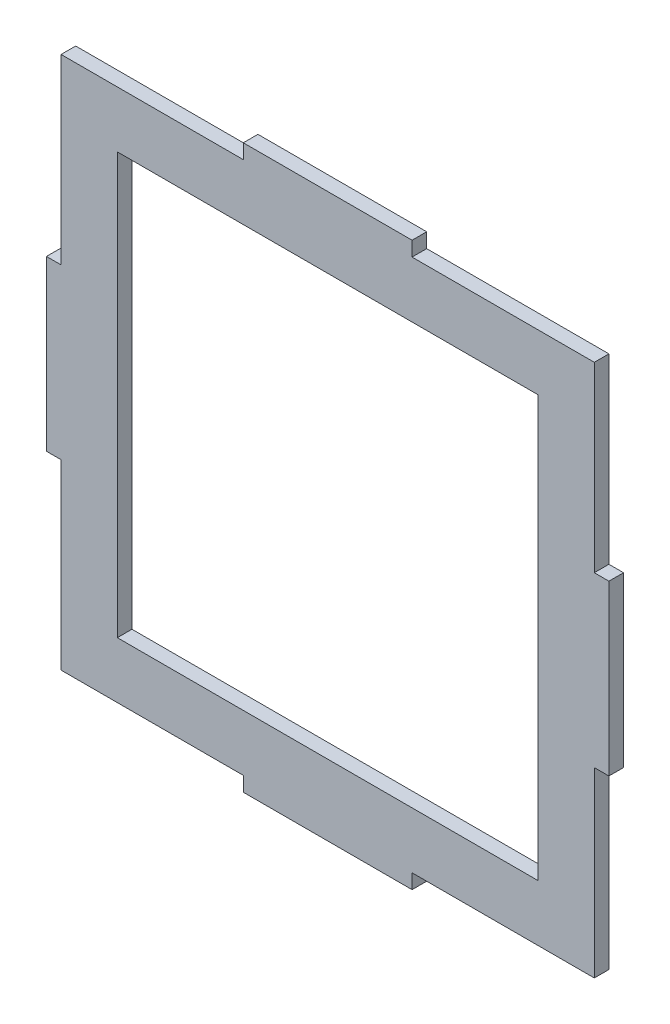
ISO-10303-21;
HEADER;
FILE_DESCRIPTION(('STEP AP214'),'2;1');
FILE_NAME('part.step','',(''),(''),'','','');
FILE_SCHEMA(('AUTOMOTIVE_DESIGN { 1 0 10303 214 1 1 1 1 }'));
ENDSEC;
DATA;
#1=APPLICATION_CONTEXT('core data for automotive mechanical design processes');
#2=APPLICATION_PROTOCOL_DEFINITION('international standard','automotive_design',2000,#1);
#3=PRODUCT_CONTEXT('',#1,'mechanical');
#4=PRODUCT('Part','Part','',(#3));
#5=PRODUCT_RELATED_PRODUCT_CATEGORY('part','',(#4));
#6=PRODUCT_DEFINITION_FORMATION('','',#4);
#7=PRODUCT_DEFINITION_CONTEXT('part definition',#1,'design');
#8=PRODUCT_DEFINITION('design','',#6,#7);
#9=PRODUCT_DEFINITION_SHAPE('','',#8);
#10=(LENGTH_UNIT() NAMED_UNIT(*) SI_UNIT(.MILLI.,.METRE.));
#11=(NAMED_UNIT(*) PLANE_ANGLE_UNIT() SI_UNIT($,.RADIAN.));
#12=(NAMED_UNIT(*) SI_UNIT($,.STERADIAN.) SOLID_ANGLE_UNIT());
#13=UNCERTAINTY_MEASURE_WITH_UNIT(LENGTH_MEASURE(1.E-05),#10,'distance_accuracy_value','');
#14=(GEOMETRIC_REPRESENTATION_CONTEXT(3) GLOBAL_UNCERTAINTY_ASSIGNED_CONTEXT((#13)) GLOBAL_UNIT_ASSIGNED_CONTEXT((#10,
#11,#12)) REPRESENTATION_CONTEXT('',''));
#15=CARTESIAN_POINT('',(0.,0.,0.));
#16=DIRECTION('',(0.,0.,1.));
#17=DIRECTION('',(1.,0.,0.));
#18=AXIS2_PLACEMENT_3D('',#15,#16,#17);
#19=CARTESIAN_POINT('',(0.,0.,2.6));
#20=DIRECTION('',(1.,0.,0.));
#21=DIRECTION('',(0.,1.,0.));
#22=AXIS2_PLACEMENT_3D('',#19,#20,#21);
#23=PLANE('',#22);
#24=DIRECTION('',(0.,-1.,0.));
#25=VECTOR('',#24,1.);
#26=CARTESIAN_POINT('',(0.,0.,0.));
#27=LINE('',#26,#25);
#28=CARTESIAN_POINT('',(0.,32.4,0.));
#29=VERTEX_POINT('',#28);
#30=CARTESIAN_POINT('',(0.,0.,0.));
#31=VERTEX_POINT('',#30);
#32=EDGE_CURVE('E223',#29,#31,#27,.T.);
#33=ORIENTED_EDGE('',*,*,#32,.T.);
#34=DIRECTION('',(0.,0.,-1.));
#35=VECTOR('',#34,1.);
#36=CARTESIAN_POINT('',(0.,0.,2.6));
#37=LINE('',#36,#35);
#38=CARTESIAN_POINT('',(0.,0.,2.6));
#39=VERTEX_POINT('',#38);
#40=EDGE_CURVE('E11',#39,#31,#37,.T.);
#41=ORIENTED_EDGE('',*,*,#40,.F.);
#42=DIRECTION('',(0.,-1.,0.));
#43=VECTOR('',#42,1.);
#44=CARTESIAN_POINT('',(0.,0.,2.6));
#45=LINE('',#44,#43);
#46=CARTESIAN_POINT('',(0.,32.4,2.6));
#47=VERTEX_POINT('',#46);
#48=EDGE_CURVE('E227',#47,#39,#45,.T.);
#49=ORIENTED_EDGE('',*,*,#48,.F.);
#50=DIRECTION('',(0.,0.,-1.));
#51=VECTOR('',#50,1.);
#52=CARTESIAN_POINT('',(0.,32.4,2.6));
#53=LINE('',#52,#51);
#54=EDGE_CURVE('E269',#47,#29,#53,.T.);
#55=ORIENTED_EDGE('',*,*,#54,.T.);
#56=EDGE_LOOP('',(#33,#41,#49,#55));
#57=FACE_BOUND('',#56,.T.);
#58=ADVANCED_FACE('F30',(#57),#23,.F.);
#59=CARTESIAN_POINT('',(0.,0.,2.6));
#60=DIRECTION('',(0.,1.,0.));
#61=DIRECTION('',(0.,0.,1.));
#62=AXIS2_PLACEMENT_3D('',#59,#60,#61);
#63=PLANE('',#62);
#64=DIRECTION('',(1.,0.,0.));
#65=VECTOR('',#64,1.);
#66=CARTESIAN_POINT('',(0.,0.,0.));
#67=LINE('',#66,#65);
#68=CARTESIAN_POINT('',(32.4,0.,0.));
#69=VERTEX_POINT('',#68);
#70=EDGE_CURVE('E272',#31,#69,#67,.T.);
#71=ORIENTED_EDGE('',*,*,#70,.T.);
#72=DIRECTION('',(0.,0.,-1.));
#73=VECTOR('',#72,1.);
#74=CARTESIAN_POINT('',(32.4,0.,2.6));
#75=LINE('',#74,#73);
#76=CARTESIAN_POINT('',(32.4,0.,2.6));
#77=VERTEX_POINT('',#76);
#78=EDGE_CURVE('E37',#77,#69,#75,.T.);
#79=ORIENTED_EDGE('',*,*,#78,.F.);
#80=DIRECTION('',(1.,0.,0.));
#81=VECTOR('',#80,1.);
#82=CARTESIAN_POINT('',(0.,0.,2.6));
#83=LINE('',#82,#81);
#84=EDGE_CURVE('E230',#39,#77,#83,.T.);
#85=ORIENTED_EDGE('',*,*,#84,.F.);
#86=ORIENTED_EDGE('',*,*,#40,.T.);
#87=EDGE_LOOP('',(#71,#79,#85,#86));
#88=FACE_BOUND('',#87,.T.);
#89=ADVANCED_FACE('F387',(#88),#63,.F.);
#90=CARTESIAN_POINT('',(32.4,0.,2.6));
#91=DIRECTION('',(1.,0.,0.));
#92=DIRECTION('',(0.,0.,-1.));
#93=AXIS2_PLACEMENT_3D('',#90,#91,#92);
#94=PLANE('',#93);
#95=DIRECTION('',(0.,-1.,0.));
#96=VECTOR('',#95,1.);
#97=CARTESIAN_POINT('',(32.4,0.,0.));
#98=LINE('',#97,#96);
#99=CARTESIAN_POINT('',(32.4,-2.60000000000001,0.));
#100=VERTEX_POINT('',#99);
#101=EDGE_CURVE('E274',#69,#100,#98,.T.);
#102=ORIENTED_EDGE('',*,*,#101,.T.);
#103=DIRECTION('',(0.,0.,-1.));
#104=VECTOR('',#103,1.);
#105=CARTESIAN_POINT('',(32.4,-2.60000000000001,2.6));
#106=LINE('',#105,#104);
#107=CARTESIAN_POINT('',(32.4,-2.60000000000001,2.6));
#108=VERTEX_POINT('',#107);
#109=EDGE_CURVE('E359',#108,#100,#106,.T.);
#110=ORIENTED_EDGE('',*,*,#109,.F.);
#111=DIRECTION('',(0.,-1.,0.));
#112=VECTOR('',#111,1.);
#113=CARTESIAN_POINT('',(32.4,0.,2.6));
#114=LINE('',#113,#112);
#115=EDGE_CURVE('E233',#77,#108,#114,.T.);
#116=ORIENTED_EDGE('',*,*,#115,.F.);
#117=ORIENTED_EDGE('',*,*,#78,.T.);
#118=EDGE_LOOP('',(#102,#110,#116,#117));
#119=FACE_BOUND('',#118,.T.);
#120=ADVANCED_FACE('F366',(#119),#94,.F.);
#121=CARTESIAN_POINT('',(62.4,-2.6,2.6));
#122=DIRECTION('',(0.,1.,0.));
#123=DIRECTION('',(-1.,0.,0.));
#124=AXIS2_PLACEMENT_3D('',#121,#122,#123);
#125=PLANE('',#124);
#126=DIRECTION('',(1.,0.,0.));
#127=VECTOR('',#126,1.);
#128=CARTESIAN_POINT('',(62.4,-2.6,0.));
#129=LINE('',#128,#127);
#130=CARTESIAN_POINT('',(62.4,-2.6,0.));
#131=VERTEX_POINT('',#130);
#132=EDGE_CURVE('E276',#100,#131,#129,.T.);
#133=ORIENTED_EDGE('',*,*,#132,.T.);
#134=DIRECTION('',(0.,0.,-1.));
#135=VECTOR('',#134,1.);
#136=CARTESIAN_POINT('',(62.4,-2.6,2.6));
#137=LINE('',#136,#135);
#138=CARTESIAN_POINT('',(62.4,-2.6,2.6));
#139=VERTEX_POINT('',#138);
#140=EDGE_CURVE('E356',#139,#131,#137,.T.);
#141=ORIENTED_EDGE('',*,*,#140,.F.);
#142=DIRECTION('',(1.,0.,0.));
#143=VECTOR('',#142,1.);
#144=CARTESIAN_POINT('',(62.4,-2.6,2.6));
#145=LINE('',#144,#143);
#146=EDGE_CURVE('E235',#108,#139,#145,.T.);
#147=ORIENTED_EDGE('',*,*,#146,.F.);
#148=ORIENTED_EDGE('',*,*,#109,.T.);
#149=EDGE_LOOP('',(#133,#141,#147,#148));
#150=FACE_BOUND('',#149,.T.);
#151=ADVANCED_FACE('F375',(#150),#125,.F.);
#152=CARTESIAN_POINT('',(62.4,0.,2.6));
#153=DIRECTION('',(-1.,0.,0.));
#154=DIRECTION('',(0.,-1.,0.));
#155=AXIS2_PLACEMENT_3D('',#152,#153,#154);
#156=PLANE('',#155);
#157=DIRECTION('',(0.,1.,0.));
#158=VECTOR('',#157,1.);
#159=CARTESIAN_POINT('',(62.4,0.,0.));
#160=LINE('',#159,#158);
#161=CARTESIAN_POINT('',(62.4,0.,0.));
#162=VERTEX_POINT('',#161);
#163=EDGE_CURVE('E278',#131,#162,#160,.T.);
#164=ORIENTED_EDGE('',*,*,#163,.T.);
#165=DIRECTION('',(0.,0.,-1.));
#166=VECTOR('',#165,1.);
#167=CARTESIAN_POINT('',(62.4,0.,2.6));
#168=LINE('',#167,#166);
#169=CARTESIAN_POINT('',(62.4,0.,2.6));
#170=VERTEX_POINT('',#169);
#171=EDGE_CURVE('E353',#170,#162,#168,.T.);
#172=ORIENTED_EDGE('',*,*,#171,.F.);
#173=DIRECTION('',(0.,1.,0.));
#174=VECTOR('',#173,1.);
#175=CARTESIAN_POINT('',(62.4,0.,2.6));
#176=LINE('',#175,#174);
#177=EDGE_CURVE('E237',#139,#170,#176,.T.);
#178=ORIENTED_EDGE('',*,*,#177,.F.);
#179=ORIENTED_EDGE('',*,*,#140,.T.);
#180=EDGE_LOOP('',(#164,#172,#178,#179));
#181=FACE_BOUND('',#180,.T.);
#182=ADVANCED_FACE('F379',(#181),#156,.F.);
#183=CARTESIAN_POINT('',(62.4,0.,2.6));
#184=DIRECTION('',(0.,1.,0.));
#185=DIRECTION('',(0.,0.,1.));
#186=AXIS2_PLACEMENT_3D('',#183,#184,#185);
#187=PLANE('',#186);
#188=DIRECTION('',(1.,0.,0.));
#189=VECTOR('',#188,1.);
#190=CARTESIAN_POINT('',(62.4,0.,0.));
#191=LINE('',#190,#189);
#192=CARTESIAN_POINT('',(94.8,0.,0.));
#193=VERTEX_POINT('',#192);
#194=EDGE_CURVE('E280',#162,#193,#191,.T.);
#195=ORIENTED_EDGE('',*,*,#194,.T.);
#196=DIRECTION('',(0.,0.,-1.));
#197=VECTOR('',#196,1.);
#198=CARTESIAN_POINT('',(94.8,0.,2.6));
#199=LINE('',#198,#197);
#200=CARTESIAN_POINT('',(94.8,0.,2.6));
#201=VERTEX_POINT('',#200);
#202=EDGE_CURVE('E350',#201,#193,#199,.T.);
#203=ORIENTED_EDGE('',*,*,#202,.F.);
#204=DIRECTION('',(1.,0.,0.));
#205=VECTOR('',#204,1.);
#206=CARTESIAN_POINT('',(62.4,0.,2.6));
#207=LINE('',#206,#205);
#208=EDGE_CURVE('E239',#170,#201,#207,.T.);
#209=ORIENTED_EDGE('',*,*,#208,.F.);
#210=ORIENTED_EDGE('',*,*,#171,.T.);
#211=EDGE_LOOP('',(#195,#203,#209,#210));
#212=FACE_BOUND('',#211,.T.);
#213=ADVANCED_FACE('F460',(#212),#187,.F.);
#214=CARTESIAN_POINT('',(94.8,0.,2.6));
#215=DIRECTION('',(-1.,0.,0.));
#216=DIRECTION('',(0.,0.,1.));
#217=AXIS2_PLACEMENT_3D('',#214,#215,#216);
#218=PLANE('',#217);
#219=DIRECTION('',(0.,1.,0.));
#220=VECTOR('',#219,1.);
#221=CARTESIAN_POINT('',(94.8,0.,0.));
#222=LINE('',#221,#220);
#223=CARTESIAN_POINT('',(94.8,32.4,0.));
#224=VERTEX_POINT('',#223);
#225=EDGE_CURVE('E282',#193,#224,#222,.T.);
#226=ORIENTED_EDGE('',*,*,#225,.T.);
#227=DIRECTION('',(0.,0.,-1.));
#228=VECTOR('',#227,1.);
#229=CARTESIAN_POINT('',(94.8,32.4,2.6));
#230=LINE('',#229,#228);
#231=CARTESIAN_POINT('',(94.8,32.4,2.6));
#232=VERTEX_POINT('',#231);
#233=EDGE_CURVE('E347',#232,#224,#230,.T.);
#234=ORIENTED_EDGE('',*,*,#233,.F.);
#235=DIRECTION('',(0.,1.,0.));
#236=VECTOR('',#235,1.);
#237=CARTESIAN_POINT('',(94.8,0.,2.6));
#238=LINE('',#237,#236);
#239=EDGE_CURVE('E241',#201,#232,#238,.T.);
#240=ORIENTED_EDGE('',*,*,#239,.F.);
#241=ORIENTED_EDGE('',*,*,#202,.T.);
#242=EDGE_LOOP('',(#226,#234,#240,#241));
#243=FACE_BOUND('',#242,.T.);
#244=ADVANCED_FACE('F458',(#243),#218,.F.);
#245=CARTESIAN_POINT('',(94.8,32.4,2.6));
#246=DIRECTION('',(0.,1.,0.));
#247=DIRECTION('',(-1.,0.,0.));
#248=AXIS2_PLACEMENT_3D('',#245,#246,#247);
#249=PLANE('',#248);
#250=DIRECTION('',(1.,0.,0.));
#251=VECTOR('',#250,1.);
#252=CARTESIAN_POINT('',(94.8,32.4,0.));
#253=LINE('',#252,#251);
#254=CARTESIAN_POINT('',(97.4,32.4,0.));
#255=VERTEX_POINT('',#254);
#256=EDGE_CURVE('E284',#224,#255,#253,.T.);
#257=ORIENTED_EDGE('',*,*,#256,.T.);
#258=DIRECTION('',(0.,0.,-1.));
#259=VECTOR('',#258,1.);
#260=CARTESIAN_POINT('',(97.4,32.4,2.6));
#261=LINE('',#260,#259);
#262=CARTESIAN_POINT('',(97.4,32.4,2.6));
#263=VERTEX_POINT('',#262);
#264=EDGE_CURVE('E344',#263,#255,#261,.T.);
#265=ORIENTED_EDGE('',*,*,#264,.F.);
#266=DIRECTION('',(1.,0.,0.));
#267=VECTOR('',#266,1.);
#268=CARTESIAN_POINT('',(94.8,32.4,2.6));
#269=LINE('',#268,#267);
#270=EDGE_CURVE('E243',#232,#263,#269,.T.);
#271=ORIENTED_EDGE('',*,*,#270,.F.);
#272=ORIENTED_EDGE('',*,*,#233,.T.);
#273=EDGE_LOOP('',(#257,#265,#271,#272));
#274=FACE_BOUND('',#273,.T.);
#275=ADVANCED_FACE('F453',(#274),#249,.F.);
#276=CARTESIAN_POINT('',(97.4,62.4,2.6));
#277=DIRECTION('',(-1.,0.,0.));
#278=DIRECTION('',(0.,0.,1.));
#279=AXIS2_PLACEMENT_3D('',#276,#277,#278);
#280=PLANE('',#279);
#281=DIRECTION('',(0.,1.,0.));
#282=VECTOR('',#281,1.);
#283=CARTESIAN_POINT('',(97.4,62.4,0.));
#284=LINE('',#283,#282);
#285=CARTESIAN_POINT('',(97.4,62.4,0.));
#286=VERTEX_POINT('',#285);
#287=EDGE_CURVE('E286',#255,#286,#284,.T.);
#288=ORIENTED_EDGE('',*,*,#287,.T.);
#289=DIRECTION('',(0.,0.,-1.));
#290=VECTOR('',#289,1.);
#291=CARTESIAN_POINT('',(97.4,62.4,2.6));
#292=LINE('',#291,#290);
#293=CARTESIAN_POINT('',(97.4,62.4,2.6));
#294=VERTEX_POINT('',#293);
#295=EDGE_CURVE('E341',#294,#286,#292,.T.);
#296=ORIENTED_EDGE('',*,*,#295,.F.);
#297=DIRECTION('',(0.,1.,0.));
#298=VECTOR('',#297,1.);
#299=CARTESIAN_POINT('',(97.4,62.4,2.6));
#300=LINE('',#299,#298);
#301=EDGE_CURVE('E245',#263,#294,#300,.T.);
#302=ORIENTED_EDGE('',*,*,#301,.F.);
#303=ORIENTED_EDGE('',*,*,#264,.T.);
#304=EDGE_LOOP('',(#288,#296,#302,#303));
#305=FACE_BOUND('',#304,.T.);
#306=ADVANCED_FACE('F448',(#305),#280,.F.);
#307=CARTESIAN_POINT('',(94.8,62.4,2.6));
#308=DIRECTION('',(0.,-1.,0.));
#309=DIRECTION('',(0.,0.,-1.));
#310=AXIS2_PLACEMENT_3D('',#307,#308,#309);
#311=PLANE('',#310);
#312=DIRECTION('',(-1.,0.,0.));
#313=VECTOR('',#312,1.);
#314=CARTESIAN_POINT('',(94.8,62.4,0.));
#315=LINE('',#314,#313);
#316=CARTESIAN_POINT('',(94.8,62.4,0.));
#317=VERTEX_POINT('',#316);
#318=EDGE_CURVE('E288',#286,#317,#315,.T.);
#319=ORIENTED_EDGE('',*,*,#318,.T.);
#320=DIRECTION('',(0.,0.,-1.));
#321=VECTOR('',#320,1.);
#322=CARTESIAN_POINT('',(94.8,62.4,2.6));
#323=LINE('',#322,#321);
#324=CARTESIAN_POINT('',(94.8,62.4,2.6));
#325=VERTEX_POINT('',#324);
#326=EDGE_CURVE('E338',#325,#317,#323,.T.);
#327=ORIENTED_EDGE('',*,*,#326,.F.);
#328=DIRECTION('',(-1.,0.,0.));
#329=VECTOR('',#328,1.);
#330=CARTESIAN_POINT('',(94.8,62.4,2.6));
#331=LINE('',#330,#329);
#332=EDGE_CURVE('E247',#294,#325,#331,.T.);
#333=ORIENTED_EDGE('',*,*,#332,.F.);
#334=ORIENTED_EDGE('',*,*,#295,.T.);
#335=EDGE_LOOP('',(#319,#327,#333,#334));
#336=FACE_BOUND('',#335,.T.);
#337=ADVANCED_FACE('F444',(#336),#311,.F.);
#338=CARTESIAN_POINT('',(94.8,62.4,2.6));
#339=DIRECTION('',(-1.,0.,0.));
#340=DIRECTION('',(0.,0.,1.));
#341=AXIS2_PLACEMENT_3D('',#338,#339,#340);
#342=PLANE('',#341);
#343=DIRECTION('',(0.,1.,0.));
#344=VECTOR('',#343,1.);
#345=CARTESIAN_POINT('',(94.8,62.4,0.));
#346=LINE('',#345,#344);
#347=CARTESIAN_POINT('',(94.8,94.8,0.));
#348=VERTEX_POINT('',#347);
#349=EDGE_CURVE('E290',#317,#348,#346,.T.);
#350=ORIENTED_EDGE('',*,*,#349,.T.);
#351=DIRECTION('',(0.,0.,-1.));
#352=VECTOR('',#351,1.);
#353=CARTESIAN_POINT('',(94.8,94.8,2.6));
#354=LINE('',#353,#352);
#355=CARTESIAN_POINT('',(94.8,94.8,2.6));
#356=VERTEX_POINT('',#355);
#357=EDGE_CURVE('E335',#356,#348,#354,.T.);
#358=ORIENTED_EDGE('',*,*,#357,.F.);
#359=DIRECTION('',(0.,1.,0.));
#360=VECTOR('',#359,1.);
#361=CARTESIAN_POINT('',(94.8,62.4,2.6));
#362=LINE('',#361,#360);
#363=EDGE_CURVE('E249',#325,#356,#362,.T.);
#364=ORIENTED_EDGE('',*,*,#363,.F.);
#365=ORIENTED_EDGE('',*,*,#326,.T.);
#366=EDGE_LOOP('',(#350,#358,#364,#365));
#367=FACE_BOUND('',#366,.T.);
#368=ADVANCED_FACE('F439',(#367),#342,.F.);
#369=CARTESIAN_POINT('',(62.4,94.8,2.6));
#370=DIRECTION('',(0.,-1.,0.));
#371=DIRECTION('',(0.,0.,-1.));
#372=AXIS2_PLACEMENT_3D('',#369,#370,#371);
#373=PLANE('',#372);
#374=DIRECTION('',(-1.,0.,0.));
#375=VECTOR('',#374,1.);
#376=CARTESIAN_POINT('',(62.4,94.8,0.));
#377=LINE('',#376,#375);
#378=CARTESIAN_POINT('',(62.4,94.8,0.));
#379=VERTEX_POINT('',#378);
#380=EDGE_CURVE('E292',#348,#379,#377,.T.);
#381=ORIENTED_EDGE('',*,*,#380,.T.);
#382=DIRECTION('',(0.,0.,-1.));
#383=VECTOR('',#382,1.);
#384=CARTESIAN_POINT('',(62.4,94.8,2.6));
#385=LINE('',#384,#383);
#386=CARTESIAN_POINT('',(62.4,94.8,2.6));
#387=VERTEX_POINT('',#386);
#388=EDGE_CURVE('E332',#387,#379,#385,.T.);
#389=ORIENTED_EDGE('',*,*,#388,.F.);
#390=DIRECTION('',(-1.,0.,0.));
#391=VECTOR('',#390,1.);
#392=CARTESIAN_POINT('',(62.4,94.8,2.6));
#393=LINE('',#392,#391);
#394=EDGE_CURVE('E251',#356,#387,#393,.T.);
#395=ORIENTED_EDGE('',*,*,#394,.F.);
#396=ORIENTED_EDGE('',*,*,#357,.T.);
#397=EDGE_LOOP('',(#381,#389,#395,#396));
#398=FACE_BOUND('',#397,.T.);
#399=ADVANCED_FACE('F433',(#398),#373,.F.);
#400=CARTESIAN_POINT('',(62.4,94.8,2.6));
#401=DIRECTION('',(-1.,0.,0.));
#402=DIRECTION('',(0.,0.,1.));
#403=AXIS2_PLACEMENT_3D('',#400,#401,#402);
#404=PLANE('',#403);
#405=DIRECTION('',(0.,1.,0.));
#406=VECTOR('',#405,1.);
#407=CARTESIAN_POINT('',(62.4,94.8,0.));
#408=LINE('',#407,#406);
#409=CARTESIAN_POINT('',(62.4,97.4,0.));
#410=VERTEX_POINT('',#409);
#411=EDGE_CURVE('E294',#379,#410,#408,.T.);
#412=ORIENTED_EDGE('',*,*,#411,.T.);
#413=DIRECTION('',(0.,0.,-1.));
#414=VECTOR('',#413,1.);
#415=CARTESIAN_POINT('',(62.4,97.4,2.6));
#416=LINE('',#415,#414);
#417=CARTESIAN_POINT('',(62.4,97.4,2.6));
#418=VERTEX_POINT('',#417);
#419=EDGE_CURVE('E329',#418,#410,#416,.T.);
#420=ORIENTED_EDGE('',*,*,#419,.F.);
#421=DIRECTION('',(0.,1.,0.));
#422=VECTOR('',#421,1.);
#423=CARTESIAN_POINT('',(62.4,94.8,2.6));
#424=LINE('',#423,#422);
#425=EDGE_CURVE('E253',#387,#418,#424,.T.);
#426=ORIENTED_EDGE('',*,*,#425,.F.);
#427=ORIENTED_EDGE('',*,*,#388,.T.);
#428=EDGE_LOOP('',(#412,#420,#426,#427));
#429=FACE_BOUND('',#428,.T.);
#430=ADVANCED_FACE('F429',(#429),#404,.F.);
#431=CARTESIAN_POINT('',(32.4,97.4,2.6));
#432=DIRECTION('',(0.,-1.,0.));
#433=DIRECTION('',(0.,0.,-1.));
#434=AXIS2_PLACEMENT_3D('',#431,#432,#433);
#435=PLANE('',#434);
#436=DIRECTION('',(-1.,0.,0.));
#437=VECTOR('',#436,1.);
#438=CARTESIAN_POINT('',(32.4,97.4,0.));
#439=LINE('',#438,#437);
#440=CARTESIAN_POINT('',(32.4,97.4,0.));
#441=VERTEX_POINT('',#440);
#442=EDGE_CURVE('E296',#410,#441,#439,.T.);
#443=ORIENTED_EDGE('',*,*,#442,.T.);
#444=DIRECTION('',(0.,0.,-1.));
#445=VECTOR('',#444,1.);
#446=CARTESIAN_POINT('',(32.4,97.4,2.6));
#447=LINE('',#446,#445);
#448=CARTESIAN_POINT('',(32.4,97.4,2.6));
#449=VERTEX_POINT('',#448);
#450=EDGE_CURVE('E326',#449,#441,#447,.T.);
#451=ORIENTED_EDGE('',*,*,#450,.F.);
#452=DIRECTION('',(-1.,0.,0.));
#453=VECTOR('',#452,1.);
#454=CARTESIAN_POINT('',(32.4,97.4,2.6));
#455=LINE('',#454,#453);
#456=EDGE_CURVE('E255',#418,#449,#455,.T.);
#457=ORIENTED_EDGE('',*,*,#456,.F.);
#458=ORIENTED_EDGE('',*,*,#419,.T.);
#459=EDGE_LOOP('',(#443,#451,#457,#458));
#460=FACE_BOUND('',#459,.T.);
#461=ADVANCED_FACE('F424',(#460),#435,.F.);
#462=CARTESIAN_POINT('',(32.4,94.8,2.6));
#463=DIRECTION('',(1.,0.,0.));
#464=DIRECTION('',(0.,0.,-1.));
#465=AXIS2_PLACEMENT_3D('',#462,#463,#464);
#466=PLANE('',#465);
#467=DIRECTION('',(0.,-1.,0.));
#468=VECTOR('',#467,1.);
#469=CARTESIAN_POINT('',(32.4,94.8,0.));
#470=LINE('',#469,#468);
#471=CARTESIAN_POINT('',(32.4,94.8,0.));
#472=VERTEX_POINT('',#471);
#473=EDGE_CURVE('E298',#441,#472,#470,.T.);
#474=ORIENTED_EDGE('',*,*,#473,.T.);
#475=DIRECTION('',(0.,0.,-1.));
#476=VECTOR('',#475,1.);
#477=CARTESIAN_POINT('',(32.4,94.8,2.6));
#478=LINE('',#477,#476);
#479=CARTESIAN_POINT('',(32.4,94.8,2.6));
#480=VERTEX_POINT('',#479);
#481=EDGE_CURVE('E323',#480,#472,#478,.T.);
#482=ORIENTED_EDGE('',*,*,#481,.F.);
#483=DIRECTION('',(0.,-1.,0.));
#484=VECTOR('',#483,1.);
#485=CARTESIAN_POINT('',(32.4,94.8,2.6));
#486=LINE('',#485,#484);
#487=EDGE_CURVE('E257',#449,#480,#486,.T.);
#488=ORIENTED_EDGE('',*,*,#487,.F.);
#489=ORIENTED_EDGE('',*,*,#450,.T.);
#490=EDGE_LOOP('',(#474,#482,#488,#489));
#491=FACE_BOUND('',#490,.T.);
#492=ADVANCED_FACE('F418',(#491),#466,.F.);
#493=CARTESIAN_POINT('',(0.,94.8,2.6));
#494=DIRECTION('',(0.,-1.,0.));
#495=DIRECTION('',(0.,0.,-1.));
#496=AXIS2_PLACEMENT_3D('',#493,#494,#495);
#497=PLANE('',#496);
#498=DIRECTION('',(-1.,0.,0.));
#499=VECTOR('',#498,1.);
#500=CARTESIAN_POINT('',(0.,94.8,0.));
#501=LINE('',#500,#499);
#502=CARTESIAN_POINT('',(0.,94.8,0.));
#503=VERTEX_POINT('',#502);
#504=EDGE_CURVE('E300',#472,#503,#501,.T.);
#505=ORIENTED_EDGE('',*,*,#504,.T.);
#506=DIRECTION('',(0.,0.,-1.));
#507=VECTOR('',#506,1.);
#508=CARTESIAN_POINT('',(0.,94.8,2.6));
#509=LINE('',#508,#507);
#510=CARTESIAN_POINT('',(0.,94.8,2.6));
#511=VERTEX_POINT('',#510);
#512=EDGE_CURVE('E320',#511,#503,#509,.T.);
#513=ORIENTED_EDGE('',*,*,#512,.F.);
#514=DIRECTION('',(-1.,0.,0.));
#515=VECTOR('',#514,1.);
#516=CARTESIAN_POINT('',(0.,94.8,2.6));
#517=LINE('',#516,#515);
#518=EDGE_CURVE('E259',#480,#511,#517,.T.);
#519=ORIENTED_EDGE('',*,*,#518,.F.);
#520=ORIENTED_EDGE('',*,*,#481,.T.);
#521=EDGE_LOOP('',(#505,#513,#519,#520));
#522=FACE_BOUND('',#521,.T.);
#523=ADVANCED_FACE('F414',(#522),#497,.F.);
#524=CARTESIAN_POINT('',(0.,62.4,2.6));
#525=DIRECTION('',(1.,0.,0.));
#526=DIRECTION('',(0.,1.,0.));
#527=AXIS2_PLACEMENT_3D('',#524,#525,#526);
#528=PLANE('',#527);
#529=DIRECTION('',(0.,-1.,0.));
#530=VECTOR('',#529,1.);
#531=CARTESIAN_POINT('',(0.,62.4,0.));
#532=LINE('',#531,#530);
#533=CARTESIAN_POINT('',(0.,62.4,0.));
#534=VERTEX_POINT('',#533);
#535=EDGE_CURVE('E302',#503,#534,#532,.T.);
#536=ORIENTED_EDGE('',*,*,#535,.T.);
#537=DIRECTION('',(0.,0.,-1.));
#538=VECTOR('',#537,1.);
#539=CARTESIAN_POINT('',(0.,62.4,2.6));
#540=LINE('',#539,#538);
#541=CARTESIAN_POINT('',(0.,62.4,2.6));
#542=VERTEX_POINT('',#541);
#543=EDGE_CURVE('E317',#542,#534,#540,.T.);
#544=ORIENTED_EDGE('',*,*,#543,.F.);
#545=DIRECTION('',(0.,-1.,0.));
#546=VECTOR('',#545,1.);
#547=CARTESIAN_POINT('',(0.,62.4,2.6));
#548=LINE('',#547,#546);
#549=EDGE_CURVE('E261',#511,#542,#548,.T.);
#550=ORIENTED_EDGE('',*,*,#549,.F.);
#551=ORIENTED_EDGE('',*,*,#512,.T.);
#552=EDGE_LOOP('',(#536,#544,#550,#551));
#553=FACE_BOUND('',#552,.T.);
#554=ADVANCED_FACE('F409',(#553),#528,.F.);
#555=CARTESIAN_POINT('',(0.,62.4,2.6));
#556=DIRECTION('',(0.,-1.,0.));
#557=DIRECTION('',(0.,0.,-1.));
#558=AXIS2_PLACEMENT_3D('',#555,#556,#557);
#559=PLANE('',#558);
#560=DIRECTION('',(-1.,0.,0.));
#561=VECTOR('',#560,1.);
#562=CARTESIAN_POINT('',(0.,62.4,0.));
#563=LINE('',#562,#561);
#564=CARTESIAN_POINT('',(-2.6,62.4,0.));
#565=VERTEX_POINT('',#564);
#566=EDGE_CURVE('E304',#534,#565,#563,.T.);
#567=ORIENTED_EDGE('',*,*,#566,.T.);
#568=DIRECTION('',(0.,0.,-1.));
#569=VECTOR('',#568,1.);
#570=CARTESIAN_POINT('',(-2.6,62.4,2.6));
#571=LINE('',#570,#569);
#572=CARTESIAN_POINT('',(-2.6,62.4,2.6));
#573=VERTEX_POINT('',#572);
#574=EDGE_CURVE('E314',#573,#565,#571,.T.);
#575=ORIENTED_EDGE('',*,*,#574,.F.);
#576=DIRECTION('',(-1.,0.,0.));
#577=VECTOR('',#576,1.);
#578=CARTESIAN_POINT('',(0.,62.4,2.6));
#579=LINE('',#578,#577);
#580=EDGE_CURVE('E263',#542,#573,#579,.T.);
#581=ORIENTED_EDGE('',*,*,#580,.F.);
#582=ORIENTED_EDGE('',*,*,#543,.T.);
#583=EDGE_LOOP('',(#567,#575,#581,#582));
#584=FACE_BOUND('',#583,.T.);
#585=ADVANCED_FACE('F403',(#584),#559,.F.);
#586=CARTESIAN_POINT('',(-2.6,62.4,2.6));
#587=DIRECTION('',(1.,0.,0.));
#588=DIRECTION('',(0.,1.,0.));
#589=AXIS2_PLACEMENT_3D('',#586,#587,#588);
#590=PLANE('',#589);
#591=DIRECTION('',(0.,-1.,0.));
#592=VECTOR('',#591,1.);
#593=CARTESIAN_POINT('',(-2.6,62.4,0.));
#594=LINE('',#593,#592);
#595=CARTESIAN_POINT('',(-2.6,32.4,0.));
#596=VERTEX_POINT('',#595);
#597=EDGE_CURVE('E306',#565,#596,#594,.T.);
#598=ORIENTED_EDGE('',*,*,#597,.T.);
#599=DIRECTION('',(0.,0.,-1.));
#600=VECTOR('',#599,1.);
#601=CARTESIAN_POINT('',(-2.6,32.4,2.6));
#602=LINE('',#601,#600);
#603=CARTESIAN_POINT('',(-2.6,32.4,2.6));
#604=VERTEX_POINT('',#603);
#605=EDGE_CURVE('E311',#604,#596,#602,.T.);
#606=ORIENTED_EDGE('',*,*,#605,.F.);
#607=DIRECTION('',(0.,-1.,0.));
#608=VECTOR('',#607,1.);
#609=CARTESIAN_POINT('',(-2.6,62.4,2.6));
#610=LINE('',#609,#608);
#611=EDGE_CURVE('E265',#573,#604,#610,.T.);
#612=ORIENTED_EDGE('',*,*,#611,.F.);
#613=ORIENTED_EDGE('',*,*,#574,.T.);
#614=EDGE_LOOP('',(#598,#606,#612,#613));
#615=FACE_BOUND('',#614,.T.);
#616=ADVANCED_FACE('F399',(#615),#590,.F.);
#617=CARTESIAN_POINT('',(0.,32.4,2.6));
#618=DIRECTION('',(0.,1.,0.));
#619=DIRECTION('',(0.,0.,1.));
#620=AXIS2_PLACEMENT_3D('',#617,#618,#619);
#621=PLANE('',#620);
#622=DIRECTION('',(1.,0.,0.));
#623=VECTOR('',#622,1.);
#624=CARTESIAN_POINT('',(0.,32.4,0.));
#625=LINE('',#624,#623);
#626=EDGE_CURVE('E231',#596,#29,#625,.T.);
#627=ORIENTED_EDGE('',*,*,#626,.T.);
#628=ORIENTED_EDGE('',*,*,#54,.F.);
#629=DIRECTION('',(1.,0.,0.));
#630=VECTOR('',#629,1.);
#631=CARTESIAN_POINT('',(0.,32.4,2.6));
#632=LINE('',#631,#630);
#633=EDGE_CURVE('E267',#604,#47,#632,.T.);
#634=ORIENTED_EDGE('',*,*,#633,.F.);
#635=ORIENTED_EDGE('',*,*,#605,.T.);
#636=EDGE_LOOP('',(#627,#628,#634,#635));
#637=FACE_BOUND('',#636,.T.);
#638=ADVANCED_FACE('F394',(#637),#621,.F.);
#639=CARTESIAN_POINT('',(0.,32.4,2.6));
#640=DIRECTION('',(0.,0.,1.));
#641=DIRECTION('',(1.,0.,0.));
#642=AXIS2_PLACEMENT_3D('',#639,#640,#641);
#643=PLANE('',#642);
#644=DIRECTION('',(0.,-1.,0.));
#645=VECTOR('',#644,1.);
#646=CARTESIAN_POINT('',(10.,10.,2.6));
#647=LINE('',#646,#645);
#648=CARTESIAN_POINT('',(10.,84.8,2.6));
#649=VERTEX_POINT('',#648);
#650=CARTESIAN_POINT('',(10.,10.,2.6));
#651=VERTEX_POINT('',#650);
#652=EDGE_CURVE('E44',#649,#651,#647,.T.);
#653=ORIENTED_EDGE('',*,*,#652,.F.);
#654=DIRECTION('',(-1.,0.,0.));
#655=VECTOR('',#654,1.);
#656=CARTESIAN_POINT('',(10.,84.8,2.6));
#657=LINE('',#656,#655);
#658=CARTESIAN_POINT('',(84.8,84.8,2.6));
#659=VERTEX_POINT('',#658);
#660=EDGE_CURVE('E208',#659,#649,#657,.T.);
#661=ORIENTED_EDGE('',*,*,#660,.F.);
#662=DIRECTION('',(0.,1.,0.));
#663=VECTOR('',#662,1.);
#664=CARTESIAN_POINT('',(84.8,10.,2.6));
#665=LINE('',#664,#663);
#666=CARTESIAN_POINT('',(84.8,10.,2.6));
#667=VERTEX_POINT('',#666);
#668=EDGE_CURVE('E211',#667,#659,#665,.T.);
#669=ORIENTED_EDGE('',*,*,#668,.F.);
#670=DIRECTION('',(1.,0.,0.));
#671=VECTOR('',#670,1.);
#672=CARTESIAN_POINT('',(10.,10.,2.6));
#673=LINE('',#672,#671);
#674=EDGE_CURVE('E217',#651,#667,#673,.T.);
#675=ORIENTED_EDGE('',*,*,#674,.F.);
#676=EDGE_LOOP('',(#653,#661,#669,#675));
#677=FACE_BOUND('',#676,.T.);
#678=ORIENTED_EDGE('',*,*,#48,.T.);
#679=ORIENTED_EDGE('',*,*,#84,.T.);
#680=ORIENTED_EDGE('',*,*,#115,.T.);
#681=ORIENTED_EDGE('',*,*,#146,.T.);
#682=ORIENTED_EDGE('',*,*,#177,.T.);
#683=ORIENTED_EDGE('',*,*,#208,.T.);
#684=ORIENTED_EDGE('',*,*,#239,.T.);
#685=ORIENTED_EDGE('',*,*,#270,.T.);
#686=ORIENTED_EDGE('',*,*,#301,.T.);
#687=ORIENTED_EDGE('',*,*,#332,.T.);
#688=ORIENTED_EDGE('',*,*,#363,.T.);
#689=ORIENTED_EDGE('',*,*,#394,.T.);
#690=ORIENTED_EDGE('',*,*,#425,.T.);
#691=ORIENTED_EDGE('',*,*,#456,.T.);
#692=ORIENTED_EDGE('',*,*,#487,.T.);
#693=ORIENTED_EDGE('',*,*,#518,.T.);
#694=ORIENTED_EDGE('',*,*,#549,.T.);
#695=ORIENTED_EDGE('',*,*,#580,.T.);
#696=ORIENTED_EDGE('',*,*,#611,.T.);
#697=ORIENTED_EDGE('',*,*,#633,.T.);
#698=EDGE_LOOP('',(#678,#679,#680,#681,#682,#683,#684,#685,#686,#687,#688,#689,#690,#691,#692,
#693,#694,#695,#696,#697));
#699=FACE_BOUND('',#698,.T.);
#700=ADVANCED_FACE('F383',(#677,#699),#643,.T.);
#701=CARTESIAN_POINT('',(0.,32.4,0.));
#702=DIRECTION('',(0.,0.,1.));
#703=DIRECTION('',(1.,0.,0.));
#704=AXIS2_PLACEMENT_3D('',#701,#702,#703);
#705=PLANE('',#704);
#706=DIRECTION('',(-1.,0.,0.));
#707=VECTOR('',#706,1.);
#708=CARTESIAN_POINT('',(10.,84.8,0.));
#709=LINE('',#708,#707);
#710=CARTESIAN_POINT('',(84.8,84.8,0.));
#711=VERTEX_POINT('',#710);
#712=CARTESIAN_POINT('',(10.,84.8,0.));
#713=VERTEX_POINT('',#712);
#714=EDGE_CURVE('E198',#711,#713,#709,.T.);
#715=ORIENTED_EDGE('',*,*,#714,.T.);
#716=DIRECTION('',(0.,-1.,0.));
#717=VECTOR('',#716,1.);
#718=CARTESIAN_POINT('',(10.,10.,0.));
#719=LINE('',#718,#717);
#720=CARTESIAN_POINT('',(10.,10.,0.));
#721=VERTEX_POINT('',#720);
#722=EDGE_CURVE('E192',#713,#721,#719,.T.);
#723=ORIENTED_EDGE('',*,*,#722,.T.);
#724=DIRECTION('',(1.,0.,0.));
#725=VECTOR('',#724,1.);
#726=CARTESIAN_POINT('',(10.,10.,0.));
#727=LINE('',#726,#725);
#728=CARTESIAN_POINT('',(84.8,10.,0.));
#729=VERTEX_POINT('',#728);
#730=EDGE_CURVE('E201',#721,#729,#727,.T.);
#731=ORIENTED_EDGE('',*,*,#730,.T.);
#732=DIRECTION('',(0.,1.,0.));
#733=VECTOR('',#732,1.);
#734=CARTESIAN_POINT('',(84.8,10.,0.));
#735=LINE('',#734,#733);
#736=EDGE_CURVE('E52',#729,#711,#735,.T.);
#737=ORIENTED_EDGE('',*,*,#736,.T.);
#738=EDGE_LOOP('',(#715,#723,#731,#737));
#739=FACE_BOUND('',#738,.T.);
#740=ORIENTED_EDGE('',*,*,#32,.F.);
#741=ORIENTED_EDGE('',*,*,#626,.F.);
#742=ORIENTED_EDGE('',*,*,#597,.F.);
#743=ORIENTED_EDGE('',*,*,#566,.F.);
#744=ORIENTED_EDGE('',*,*,#535,.F.);
#745=ORIENTED_EDGE('',*,*,#504,.F.);
#746=ORIENTED_EDGE('',*,*,#473,.F.);
#747=ORIENTED_EDGE('',*,*,#442,.F.);
#748=ORIENTED_EDGE('',*,*,#411,.F.);
#749=ORIENTED_EDGE('',*,*,#380,.F.);
#750=ORIENTED_EDGE('',*,*,#349,.F.);
#751=ORIENTED_EDGE('',*,*,#318,.F.);
#752=ORIENTED_EDGE('',*,*,#287,.F.);
#753=ORIENTED_EDGE('',*,*,#256,.F.);
#754=ORIENTED_EDGE('',*,*,#225,.F.);
#755=ORIENTED_EDGE('',*,*,#194,.F.);
#756=ORIENTED_EDGE('',*,*,#163,.F.);
#757=ORIENTED_EDGE('',*,*,#132,.F.);
#758=ORIENTED_EDGE('',*,*,#101,.F.);
#759=ORIENTED_EDGE('',*,*,#70,.F.);
#760=EDGE_LOOP('',(#740,#741,#742,#743,#744,#745,#746,#747,#748,#749,#750,#751,#752,#753,#754,
#755,#756,#757,#758,#759));
#761=FACE_BOUND('',#760,.T.);
#762=ADVANCED_FACE('F205',(#739,#761),#705,.F.);
#763=CARTESIAN_POINT('',(10.,10.,0.));
#764=DIRECTION('',(-1.,0.,0.));
#765=DIRECTION('',(0.,0.,1.));
#766=AXIS2_PLACEMENT_3D('',#763,#764,#765);
#767=PLANE('',#766);
#768=ORIENTED_EDGE('',*,*,#652,.T.);
#769=DIRECTION('',(0.,0.,1.));
#770=VECTOR('',#769,1.);
#771=CARTESIAN_POINT('',(10.,10.,0.));
#772=LINE('',#771,#770);
#773=EDGE_CURVE('E188',#721,#651,#772,.T.);
#774=ORIENTED_EDGE('',*,*,#773,.F.);
#775=ORIENTED_EDGE('',*,*,#722,.F.);
#776=DIRECTION('',(0.,0.,1.));
#777=VECTOR('',#776,1.);
#778=CARTESIAN_POINT('',(10.,84.8,0.));
#779=LINE('',#778,#777);
#780=EDGE_CURVE('E221',#713,#649,#779,.T.);
#781=ORIENTED_EDGE('',*,*,#780,.T.);
#782=EDGE_LOOP('',(#768,#774,#775,#781));
#783=FACE_BOUND('',#782,.T.);
#784=ADVANCED_FACE('F190',(#783),#767,.F.);
#785=CARTESIAN_POINT('',(10.,84.8,0.));
#786=DIRECTION('',(0.,1.,0.));
#787=DIRECTION('',(0.,0.,1.));
#788=AXIS2_PLACEMENT_3D('',#785,#786,#787);
#789=PLANE('',#788);
#790=ORIENTED_EDGE('',*,*,#660,.T.);
#791=ORIENTED_EDGE('',*,*,#780,.F.);
#792=ORIENTED_EDGE('',*,*,#714,.F.);
#793=DIRECTION('',(0.,0.,1.));
#794=VECTOR('',#793,1.);
#795=CARTESIAN_POINT('',(84.8,84.8,0.));
#796=LINE('',#795,#794);
#797=EDGE_CURVE('E224',#711,#659,#796,.T.);
#798=ORIENTED_EDGE('',*,*,#797,.T.);
#799=EDGE_LOOP('',(#790,#791,#792,#798));
#800=FACE_BOUND('',#799,.T.);
#801=ADVANCED_FACE('F627',(#800),#789,.F.);
#802=CARTESIAN_POINT('',(84.8,10.,0.));
#803=DIRECTION('',(1.,0.,0.));
#804=DIRECTION('',(0.,0.,-1.));
#805=AXIS2_PLACEMENT_3D('',#802,#803,#804);
#806=PLANE('',#805);
#807=ORIENTED_EDGE('',*,*,#668,.T.);
#808=ORIENTED_EDGE('',*,*,#797,.F.);
#809=ORIENTED_EDGE('',*,*,#736,.F.);
#810=DIRECTION('',(0.,0.,1.));
#811=VECTOR('',#810,1.);
#812=CARTESIAN_POINT('',(84.8,10.,0.));
#813=LINE('',#812,#811);
#814=EDGE_CURVE('E197',#729,#667,#813,.T.);
#815=ORIENTED_EDGE('',*,*,#814,.T.);
#816=EDGE_LOOP('',(#807,#808,#809,#815));
#817=FACE_BOUND('',#816,.T.);
#818=ADVANCED_FACE('F636',(#817),#806,.F.);
#819=CARTESIAN_POINT('',(10.,10.,0.));
#820=DIRECTION('',(0.,-1.,0.));
#821=DIRECTION('',(1.,0.,0.));
#822=AXIS2_PLACEMENT_3D('',#819,#820,#821);
#823=PLANE('',#822);
#824=ORIENTED_EDGE('',*,*,#674,.T.);
#825=ORIENTED_EDGE('',*,*,#814,.F.);
#826=ORIENTED_EDGE('',*,*,#730,.F.);
#827=ORIENTED_EDGE('',*,*,#773,.T.);
#828=EDGE_LOOP('',(#824,#825,#826,#827));
#829=FACE_BOUND('',#828,.T.);
#830=ADVANCED_FACE('F202',(#829),#823,.F.);
#831=CLOSED_SHELL('',(#58,#89,#120,#151,#182,#213,#244,#275,#306,#337,#368,#399,#430,#461,#492,
#523,#554,#585,#616,#638,#700,#762,#784,#801,#818,#830));
#832=MANIFOLD_SOLID_BREP('B2',#831);
#833=ADVANCED_BREP_SHAPE_REPRESENTATION('',(#18,#832),#14);
#834=SHAPE_DEFINITION_REPRESENTATION(#9,#833);
ENDSEC;
END-ISO-10303-21;
